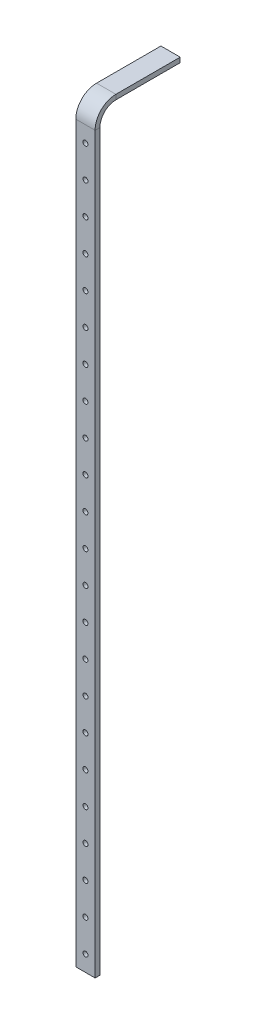
ISO-10303-21;
HEADER;
FILE_DESCRIPTION(('STEP AP214'),'2;1');
FILE_NAME('part.step','',(''),(''),'','','');
FILE_SCHEMA(('AUTOMOTIVE_DESIGN { 1 0 10303 214 1 1 1 1 }'));
ENDSEC;
DATA;
#1=APPLICATION_CONTEXT('core data for automotive mechanical design processes');
#2=APPLICATION_PROTOCOL_DEFINITION('international standard','automotive_design',2000,#1);
#3=PRODUCT_CONTEXT('',#1,'mechanical');
#4=PRODUCT('Part','Part','',(#3));
#5=PRODUCT_RELATED_PRODUCT_CATEGORY('part','',(#4));
#6=PRODUCT_DEFINITION_FORMATION('','',#4);
#7=PRODUCT_DEFINITION_CONTEXT('part definition',#1,'design');
#8=PRODUCT_DEFINITION('design','',#6,#7);
#9=PRODUCT_DEFINITION_SHAPE('','',#8);
#10=(LENGTH_UNIT() NAMED_UNIT(*) SI_UNIT(.MILLI.,.METRE.));
#11=(NAMED_UNIT(*) PLANE_ANGLE_UNIT() SI_UNIT($,.RADIAN.));
#12=(NAMED_UNIT(*) SI_UNIT($,.STERADIAN.) SOLID_ANGLE_UNIT());
#13=UNCERTAINTY_MEASURE_WITH_UNIT(LENGTH_MEASURE(1.E-05),#10,'distance_accuracy_value','');
#14=(GEOMETRIC_REPRESENTATION_CONTEXT(3) GLOBAL_UNCERTAINTY_ASSIGNED_CONTEXT((#13)) GLOBAL_UNIT_ASSIGNED_CONTEXT((#10,
#11,#12)) REPRESENTATION_CONTEXT('',''));
#15=CARTESIAN_POINT('',(0.,0.,0.));
#16=DIRECTION('',(0.,0.,1.));
#17=DIRECTION('',(1.,0.,0.));
#18=AXIS2_PLACEMENT_3D('',#15,#16,#17);
#19=CARTESIAN_POINT('',(12.7,0.,0.));
#20=DIRECTION('',(-1.,0.,0.));
#21=DIRECTION('',(0.,1.,0.));
#22=AXIS2_PLACEMENT_3D('',#19,#20,#21);
#23=PLANE('',#22);
#24=DIRECTION('',(0.,0.,-1.));
#25=VECTOR('',#24,1.);
#26=CARTESIAN_POINT('',(12.7,483.,0.));
#27=LINE('',#26,#25);
#28=CARTESIAN_POINT('',(12.7,483.,3.17500000000002));
#29=VERTEX_POINT('',#28);
#30=CARTESIAN_POINT('',(12.7,483.,0.));
#31=VERTEX_POINT('',#30);
#32=EDGE_CURVE('E13',#29,#31,#27,.T.);
#33=ORIENTED_EDGE('',*,*,#32,.F.);
#34=DIRECTION('',(0.,1.,0.));
#35=VECTOR('',#34,1.);
#36=CARTESIAN_POINT('',(12.7,0.,3.175));
#37=LINE('',#36,#35);
#38=CARTESIAN_POINT('',(12.7,0.,3.175));
#39=VERTEX_POINT('',#38);
#40=EDGE_CURVE('E186',#39,#29,#37,.T.);
#41=ORIENTED_EDGE('',*,*,#40,.F.);
#42=DIRECTION('',(0.,0.,-1.));
#43=VECTOR('',#42,1.);
#44=CARTESIAN_POINT('',(12.7,0.,0.));
#45=LINE('',#44,#43);
#46=CARTESIAN_POINT('',(12.7,0.,0.));
#47=VERTEX_POINT('',#46);
#48=EDGE_CURVE('E68',#39,#47,#45,.T.);
#49=ORIENTED_EDGE('',*,*,#48,.T.);
#50=DIRECTION('',(0.,1.,0.));
#51=VECTOR('',#50,1.);
#52=CARTESIAN_POINT('',(12.7,0.,0.));
#53=LINE('',#52,#51);
#54=EDGE_CURVE('E176',#47,#31,#53,.T.);
#55=ORIENTED_EDGE('',*,*,#54,.T.);
#56=EDGE_LOOP('',(#33,#41,#49,#55));
#57=FACE_BOUND('',#56,.T.);
#58=ADVANCED_FACE('F59',(#57),#23,.F.);
#59=CARTESIAN_POINT('',(0.,0.,0.));
#60=DIRECTION('',(0.,1.,0.));
#61=DIRECTION('',(1.,0.,0.));
#62=AXIS2_PLACEMENT_3D('',#59,#60,#61);
#63=PLANE('',#62);
#64=ORIENTED_EDGE('',*,*,#48,.F.);
#65=DIRECTION('',(-1.,0.,0.));
#66=VECTOR('',#65,1.);
#67=CARTESIAN_POINT('',(0.,0.,3.175));
#68=LINE('',#67,#66);
#69=CARTESIAN_POINT('',(0.,0.,3.175));
#70=VERTEX_POINT('',#69);
#71=EDGE_CURVE('E174',#70,#39,#68,.F.);
#72=ORIENTED_EDGE('',*,*,#71,.F.);
#73=DIRECTION('',(0.,0.,-1.));
#74=VECTOR('',#73,1.);
#75=CARTESIAN_POINT('',(0.,0.,0.));
#76=LINE('',#75,#74);
#77=CARTESIAN_POINT('',(0.,0.,0.));
#78=VERTEX_POINT('',#77);
#79=EDGE_CURVE('E77',#70,#78,#76,.T.);
#80=ORIENTED_EDGE('',*,*,#79,.T.);
#81=DIRECTION('',(1.,0.,0.));
#82=VECTOR('',#81,1.);
#83=CARTESIAN_POINT('',(0.,0.,0.));
#84=LINE('',#83,#82);
#85=EDGE_CURVE('E179',#78,#47,#84,.T.);
#86=ORIENTED_EDGE('',*,*,#85,.T.);
#87=EDGE_LOOP('',(#64,#72,#80,#86));
#88=FACE_BOUND('',#87,.T.);
#89=ADVANCED_FACE('F300',(#88),#63,.F.);
#90=CARTESIAN_POINT('',(0.,0.,0.));
#91=DIRECTION('',(1.,0.,0.));
#92=DIRECTION('',(0.,-1.,0.));
#93=AXIS2_PLACEMENT_3D('',#90,#91,#92);
#94=PLANE('',#93);
#95=ORIENTED_EDGE('',*,*,#79,.F.);
#96=DIRECTION('',(0.,1.,0.));
#97=VECTOR('',#96,1.);
#98=CARTESIAN_POINT('',(0.,0.,3.175));
#99=LINE('',#98,#97);
#100=CARTESIAN_POINT('',(0.,483.,3.175));
#101=VERTEX_POINT('',#100);
#102=EDGE_CURVE('E167',#101,#70,#99,.F.);
#103=ORIENTED_EDGE('',*,*,#102,.F.);
#104=DIRECTION('',(0.,0.,-1.));
#105=VECTOR('',#104,1.);
#106=CARTESIAN_POINT('',(0.,483.,0.));
#107=LINE('',#106,#105);
#108=CARTESIAN_POINT('',(0.,483.,0.));
#109=VERTEX_POINT('',#108);
#110=EDGE_CURVE('E181',#101,#109,#107,.T.);
#111=ORIENTED_EDGE('',*,*,#110,.T.);
#112=DIRECTION('',(0.,-1.,0.));
#113=VECTOR('',#112,1.);
#114=CARTESIAN_POINT('',(0.,0.,0.));
#115=LINE('',#114,#113);
#116=EDGE_CURVE('E171',#109,#78,#115,.T.);
#117=ORIENTED_EDGE('',*,*,#116,.T.);
#118=EDGE_LOOP('',(#95,#103,#111,#117));
#119=FACE_BOUND('',#118,.T.);
#120=ADVANCED_FACE('F302',(#119),#94,.F.);
#121=CARTESIAN_POINT('',(0.,0.,0.));
#122=DIRECTION('',(0.,0.,-1.));
#123=DIRECTION('',(-1.,0.,0.));
#124=AXIS2_PLACEMENT_3D('',#121,#122,#123);
#125=PLANE('',#124);
#126=CARTESIAN_POINT('',(6.34999999999999,10.5,0.));
#127=DIRECTION('',(0.,0.,-1.));
#128=DIRECTION('',(-1.,0.,0.));
#129=AXIS2_PLACEMENT_3D('',#126,#127,#128);
#130=CIRCLE('',#129,1.64999999999999);
#131=CARTESIAN_POINT('',(4.70000000000001,10.5,0.));
#132=VERTEX_POINT('',#131);
#133=EDGE_CURVE('E435',#132,#132,#130,.T.);
#134=ORIENTED_EDGE('',*,*,#133,.F.);
#135=EDGE_LOOP('',(#134));
#136=FACE_BOUND('',#135,.T.);
#137=CARTESIAN_POINT('',(6.34999999999999,31.5,0.));
#138=DIRECTION('',(0.,0.,-1.));
#139=DIRECTION('',(-1.,0.,0.));
#140=AXIS2_PLACEMENT_3D('',#137,#138,#139);
#141=CIRCLE('',#140,1.64999999999999);
#142=CARTESIAN_POINT('',(4.70000000000001,31.5,0.));
#143=VERTEX_POINT('',#142);
#144=EDGE_CURVE('E445',#143,#143,#141,.T.);
#145=ORIENTED_EDGE('',*,*,#144,.F.);
#146=EDGE_LOOP('',(#145));
#147=FACE_BOUND('',#146,.T.);
#148=CARTESIAN_POINT('',(6.34999999999999,52.5,0.));
#149=DIRECTION('',(0.,0.,-1.));
#150=DIRECTION('',(-1.,0.,0.));
#151=AXIS2_PLACEMENT_3D('',#148,#149,#150);
#152=CIRCLE('',#151,1.64999999999999);
#153=CARTESIAN_POINT('',(4.70000000000001,52.5,0.));
#154=VERTEX_POINT('',#153);
#155=EDGE_CURVE('E451',#154,#154,#152,.T.);
#156=ORIENTED_EDGE('',*,*,#155,.F.);
#157=EDGE_LOOP('',(#156));
#158=FACE_BOUND('',#157,.T.);
#159=CARTESIAN_POINT('',(6.34999999999999,73.5,0.));
#160=DIRECTION('',(0.,0.,-1.));
#161=DIRECTION('',(-1.,0.,0.));
#162=AXIS2_PLACEMENT_3D('',#159,#160,#161);
#163=CIRCLE('',#162,1.64999999999999);
#164=CARTESIAN_POINT('',(4.70000000000001,73.5,0.));
#165=VERTEX_POINT('',#164);
#166=EDGE_CURVE('E457',#165,#165,#163,.T.);
#167=ORIENTED_EDGE('',*,*,#166,.F.);
#168=EDGE_LOOP('',(#167));
#169=FACE_BOUND('',#168,.T.);
#170=CARTESIAN_POINT('',(6.34999999999999,94.5,0.));
#171=DIRECTION('',(0.,0.,-1.));
#172=DIRECTION('',(-1.,0.,0.));
#173=AXIS2_PLACEMENT_3D('',#170,#171,#172);
#174=CIRCLE('',#173,1.64999999999999);
#175=CARTESIAN_POINT('',(4.70000000000001,94.5,0.));
#176=VERTEX_POINT('',#175);
#177=EDGE_CURVE('E463',#176,#176,#174,.T.);
#178=ORIENTED_EDGE('',*,*,#177,.F.);
#179=EDGE_LOOP('',(#178));
#180=FACE_BOUND('',#179,.T.);
#181=CARTESIAN_POINT('',(6.34999999999999,115.5,0.));
#182=DIRECTION('',(0.,0.,-1.));
#183=DIRECTION('',(-1.,0.,0.));
#184=AXIS2_PLACEMENT_3D('',#181,#182,#183);
#185=CIRCLE('',#184,1.64999999999999);
#186=CARTESIAN_POINT('',(4.70000000000001,115.5,0.));
#187=VERTEX_POINT('',#186);
#188=EDGE_CURVE('E469',#187,#187,#185,.T.);
#189=ORIENTED_EDGE('',*,*,#188,.F.);
#190=EDGE_LOOP('',(#189));
#191=FACE_BOUND('',#190,.T.);
#192=CARTESIAN_POINT('',(6.34999999999999,136.5,0.));
#193=DIRECTION('',(0.,0.,-1.));
#194=DIRECTION('',(-1.,0.,0.));
#195=AXIS2_PLACEMENT_3D('',#192,#193,#194);
#196=CIRCLE('',#195,1.64999999999999);
#197=CARTESIAN_POINT('',(4.70000000000001,136.5,0.));
#198=VERTEX_POINT('',#197);
#199=EDGE_CURVE('E475',#198,#198,#196,.T.);
#200=ORIENTED_EDGE('',*,*,#199,.F.);
#201=EDGE_LOOP('',(#200));
#202=FACE_BOUND('',#201,.T.);
#203=CARTESIAN_POINT('',(6.34999999999999,157.5,0.));
#204=DIRECTION('',(0.,0.,-1.));
#205=DIRECTION('',(-1.,0.,0.));
#206=AXIS2_PLACEMENT_3D('',#203,#204,#205);
#207=CIRCLE('',#206,1.64999999999999);
#208=CARTESIAN_POINT('',(4.70000000000001,157.5,0.));
#209=VERTEX_POINT('',#208);
#210=EDGE_CURVE('E481',#209,#209,#207,.T.);
#211=ORIENTED_EDGE('',*,*,#210,.F.);
#212=EDGE_LOOP('',(#211));
#213=FACE_BOUND('',#212,.T.);
#214=CARTESIAN_POINT('',(6.34999999999999,178.5,0.));
#215=DIRECTION('',(0.,0.,-1.));
#216=DIRECTION('',(-1.,0.,0.));
#217=AXIS2_PLACEMENT_3D('',#214,#215,#216);
#218=CIRCLE('',#217,1.64999999999999);
#219=CARTESIAN_POINT('',(4.70000000000001,178.5,0.));
#220=VERTEX_POINT('',#219);
#221=EDGE_CURVE('E62',#220,#220,#218,.T.);
#222=ORIENTED_EDGE('',*,*,#221,.F.);
#223=EDGE_LOOP('',(#222));
#224=FACE_BOUND('',#223,.T.);
#225=CARTESIAN_POINT('',(6.34999999999999,199.5,0.));
#226=DIRECTION('',(0.,0.,-1.));
#227=DIRECTION('',(-1.,0.,0.));
#228=AXIS2_PLACEMENT_3D('',#225,#226,#227);
#229=CIRCLE('',#228,1.64999999999999);
#230=CARTESIAN_POINT('',(4.70000000000001,199.5,0.));
#231=VERTEX_POINT('',#230);
#232=EDGE_CURVE('E490',#231,#231,#229,.T.);
#233=ORIENTED_EDGE('',*,*,#232,.F.);
#234=EDGE_LOOP('',(#233));
#235=FACE_BOUND('',#234,.T.);
#236=CARTESIAN_POINT('',(6.34999999999999,220.5,0.));
#237=DIRECTION('',(0.,0.,-1.));
#238=DIRECTION('',(-1.,0.,0.));
#239=AXIS2_PLACEMENT_3D('',#236,#237,#238);
#240=CIRCLE('',#239,1.64999999999999);
#241=CARTESIAN_POINT('',(4.70000000000001,220.5,0.));
#242=VERTEX_POINT('',#241);
#243=EDGE_CURVE('E203',#242,#242,#240,.T.);
#244=ORIENTED_EDGE('',*,*,#243,.F.);
#245=EDGE_LOOP('',(#244));
#246=FACE_BOUND('',#245,.T.);
#247=CARTESIAN_POINT('',(6.34999999999999,241.5,0.));
#248=DIRECTION('',(0.,0.,-1.));
#249=DIRECTION('',(-1.,0.,0.));
#250=AXIS2_PLACEMENT_3D('',#247,#248,#249);
#251=CIRCLE('',#250,1.64999999999999);
#252=CARTESIAN_POINT('',(4.70000000000001,241.5,0.));
#253=VERTEX_POINT('',#252);
#254=EDGE_CURVE('E193',#253,#253,#251,.T.);
#255=ORIENTED_EDGE('',*,*,#254,.F.);
#256=EDGE_LOOP('',(#255));
#257=FACE_BOUND('',#256,.T.);
#258=CARTESIAN_POINT('',(6.34999999999999,262.5,0.));
#259=DIRECTION('',(0.,0.,-1.));
#260=DIRECTION('',(-1.,0.,0.));
#261=AXIS2_PLACEMENT_3D('',#258,#259,#260);
#262=CIRCLE('',#261,1.64999999999999);
#263=CARTESIAN_POINT('',(4.70000000000001,262.5,0.));
#264=VERTEX_POINT('',#263);
#265=EDGE_CURVE('E200',#264,#264,#262,.T.);
#266=ORIENTED_EDGE('',*,*,#265,.F.);
#267=EDGE_LOOP('',(#266));
#268=FACE_BOUND('',#267,.T.);
#269=CARTESIAN_POINT('',(6.34999999999999,283.5,0.));
#270=DIRECTION('',(0.,0.,-1.));
#271=DIRECTION('',(-1.,0.,0.));
#272=AXIS2_PLACEMENT_3D('',#269,#270,#271);
#273=CIRCLE('',#272,1.64999999999999);
#274=CARTESIAN_POINT('',(4.70000000000001,283.5,0.));
#275=VERTEX_POINT('',#274);
#276=EDGE_CURVE('E217',#275,#275,#273,.T.);
#277=ORIENTED_EDGE('',*,*,#276,.F.);
#278=EDGE_LOOP('',(#277));
#279=FACE_BOUND('',#278,.T.);
#280=CARTESIAN_POINT('',(6.34999999999999,304.5,0.));
#281=DIRECTION('',(0.,0.,-1.));
#282=DIRECTION('',(-1.,0.,0.));
#283=AXIS2_PLACEMENT_3D('',#280,#281,#282);
#284=CIRCLE('',#283,1.64999999999999);
#285=CARTESIAN_POINT('',(4.70000000000001,304.5,0.));
#286=VERTEX_POINT('',#285);
#287=EDGE_CURVE('E223',#286,#286,#284,.T.);
#288=ORIENTED_EDGE('',*,*,#287,.F.);
#289=EDGE_LOOP('',(#288));
#290=FACE_BOUND('',#289,.T.);
#291=CARTESIAN_POINT('',(6.34999999999999,325.5,0.));
#292=DIRECTION('',(0.,0.,-1.));
#293=DIRECTION('',(-1.,0.,0.));
#294=AXIS2_PLACEMENT_3D('',#291,#292,#293);
#295=CIRCLE('',#294,1.64999999999999);
#296=CARTESIAN_POINT('',(4.70000000000001,325.5,0.));
#297=VERTEX_POINT('',#296);
#298=EDGE_CURVE('E229',#297,#297,#295,.T.);
#299=ORIENTED_EDGE('',*,*,#298,.F.);
#300=EDGE_LOOP('',(#299));
#301=FACE_BOUND('',#300,.T.);
#302=CARTESIAN_POINT('',(6.34999999999999,346.5,0.));
#303=DIRECTION('',(0.,0.,-1.));
#304=DIRECTION('',(-1.,0.,0.));
#305=AXIS2_PLACEMENT_3D('',#302,#303,#304);
#306=CIRCLE('',#305,1.64999999999999);
#307=CARTESIAN_POINT('',(4.70000000000001,346.5,0.));
#308=VERTEX_POINT('',#307);
#309=EDGE_CURVE('E235',#308,#308,#306,.T.);
#310=ORIENTED_EDGE('',*,*,#309,.F.);
#311=EDGE_LOOP('',(#310));
#312=FACE_BOUND('',#311,.T.);
#313=CARTESIAN_POINT('',(6.34999999999999,367.5,0.));
#314=DIRECTION('',(0.,0.,-1.));
#315=DIRECTION('',(-1.,0.,0.));
#316=AXIS2_PLACEMENT_3D('',#313,#314,#315);
#317=CIRCLE('',#316,1.64999999999999);
#318=CARTESIAN_POINT('',(4.70000000000001,367.5,0.));
#319=VERTEX_POINT('',#318);
#320=EDGE_CURVE('E241',#319,#319,#317,.T.);
#321=ORIENTED_EDGE('',*,*,#320,.F.);
#322=EDGE_LOOP('',(#321));
#323=FACE_BOUND('',#322,.T.);
#324=CARTESIAN_POINT('',(6.34999999999999,388.5,0.));
#325=DIRECTION('',(0.,0.,-1.));
#326=DIRECTION('',(-1.,0.,0.));
#327=AXIS2_PLACEMENT_3D('',#324,#325,#326);
#328=CIRCLE('',#327,1.64999999999999);
#329=CARTESIAN_POINT('',(4.70000000000001,388.5,0.));
#330=VERTEX_POINT('',#329);
#331=EDGE_CURVE('E247',#330,#330,#328,.T.);
#332=ORIENTED_EDGE('',*,*,#331,.F.);
#333=EDGE_LOOP('',(#332));
#334=FACE_BOUND('',#333,.T.);
#335=CARTESIAN_POINT('',(6.34999999999999,409.5,0.));
#336=DIRECTION('',(0.,0.,-1.));
#337=DIRECTION('',(-1.,0.,0.));
#338=AXIS2_PLACEMENT_3D('',#335,#336,#337);
#339=CIRCLE('',#338,1.64999999999999);
#340=CARTESIAN_POINT('',(4.70000000000001,409.5,0.));
#341=VERTEX_POINT('',#340);
#342=EDGE_CURVE('E253',#341,#341,#339,.T.);
#343=ORIENTED_EDGE('',*,*,#342,.F.);
#344=EDGE_LOOP('',(#343));
#345=FACE_BOUND('',#344,.T.);
#346=CARTESIAN_POINT('',(6.34999999999999,430.5,0.));
#347=DIRECTION('',(0.,0.,-1.));
#348=DIRECTION('',(-1.,0.,0.));
#349=AXIS2_PLACEMENT_3D('',#346,#347,#348);
#350=CIRCLE('',#349,1.64999999999999);
#351=CARTESIAN_POINT('',(4.70000000000001,430.5,0.));
#352=VERTEX_POINT('',#351);
#353=EDGE_CURVE('E259',#352,#352,#350,.T.);
#354=ORIENTED_EDGE('',*,*,#353,.F.);
#355=EDGE_LOOP('',(#354));
#356=FACE_BOUND('',#355,.T.);
#357=CARTESIAN_POINT('',(6.34999999999999,451.5,0.));
#358=DIRECTION('',(0.,0.,-1.));
#359=DIRECTION('',(-1.,0.,0.));
#360=AXIS2_PLACEMENT_3D('',#357,#358,#359);
#361=CIRCLE('',#360,1.64999999999999);
#362=CARTESIAN_POINT('',(4.70000000000001,451.5,0.));
#363=VERTEX_POINT('',#362);
#364=EDGE_CURVE('E265',#363,#363,#361,.T.);
#365=ORIENTED_EDGE('',*,*,#364,.F.);
#366=EDGE_LOOP('',(#365));
#367=FACE_BOUND('',#366,.T.);
#368=CARTESIAN_POINT('',(6.34999999999999,472.5,0.));
#369=DIRECTION('',(0.,0.,-1.));
#370=DIRECTION('',(-1.,0.,0.));
#371=AXIS2_PLACEMENT_3D('',#368,#369,#370);
#372=CIRCLE('',#371,1.64999999999999);
#373=CARTESIAN_POINT('',(4.70000000000001,472.5,0.));
#374=VERTEX_POINT('',#373);
#375=EDGE_CURVE('E165',#374,#374,#372,.T.);
#376=ORIENTED_EDGE('',*,*,#375,.F.);
#377=EDGE_LOOP('',(#376));
#378=FACE_BOUND('',#377,.T.);
#379=ORIENTED_EDGE('',*,*,#116,.F.);
#380=DIRECTION('',(-1.,0.,0.));
#381=VECTOR('',#380,1.);
#382=CARTESIAN_POINT('',(0.,483.,0.));
#383=LINE('',#382,#381);
#384=EDGE_CURVE('E173',#31,#109,#383,.T.);
#385=ORIENTED_EDGE('',*,*,#384,.F.);
#386=ORIENTED_EDGE('',*,*,#54,.F.);
#387=ORIENTED_EDGE('',*,*,#85,.F.);
#388=EDGE_LOOP('',(#379,#385,#386,#387));
#389=FACE_BOUND('',#388,.T.);
#390=ADVANCED_FACE('F307',(#136,#147,#158,#169,#180,#191,#202,#213,#224,#235,#246,#257,#268,
#279,#290,#301,#312,#323,#334,#345,#356,#367,#378,#389),#125,.T.);
#391=CARTESIAN_POINT('',(0.,0.,3.175));
#392=DIRECTION('',(0.,0.,-1.));
#393=DIRECTION('',(-1.,0.,0.));
#394=AXIS2_PLACEMENT_3D('',#391,#392,#393);
#395=PLANE('',#394);
#396=CARTESIAN_POINT('',(6.34999999999999,10.5,3.175));
#397=DIRECTION('',(0.,0.,1.));
#398=DIRECTION('',(1.,0.,0.));
#399=AXIS2_PLACEMENT_3D('',#396,#397,#398);
#400=CIRCLE('',#399,1.64999999999999);
#401=CARTESIAN_POINT('',(7.99999999999998,10.5,3.175));
#402=VERTEX_POINT('',#401);
#403=EDGE_CURVE('E438',#402,#402,#400,.T.);
#404=ORIENTED_EDGE('',*,*,#403,.F.);
#405=EDGE_LOOP('',(#404));
#406=FACE_BOUND('',#405,.T.);
#407=CARTESIAN_POINT('',(6.34999999999999,31.5,3.175));
#408=DIRECTION('',(0.,0.,1.));
#409=DIRECTION('',(1.,0.,0.));
#410=AXIS2_PLACEMENT_3D('',#407,#408,#409);
#411=CIRCLE('',#410,1.64999999999999);
#412=CARTESIAN_POINT('',(7.99999999999998,31.5,3.175));
#413=VERTEX_POINT('',#412);
#414=EDGE_CURVE('E440',#413,#413,#411,.T.);
#415=ORIENTED_EDGE('',*,*,#414,.F.);
#416=EDGE_LOOP('',(#415));
#417=FACE_BOUND('',#416,.T.);
#418=CARTESIAN_POINT('',(6.34999999999999,52.5,3.175));
#419=DIRECTION('',(0.,0.,1.));
#420=DIRECTION('',(1.,0.,0.));
#421=AXIS2_PLACEMENT_3D('',#418,#419,#420);
#422=CIRCLE('',#421,1.64999999999999);
#423=CARTESIAN_POINT('',(7.99999999999998,52.5,3.175));
#424=VERTEX_POINT('',#423);
#425=EDGE_CURVE('E448',#424,#424,#422,.T.);
#426=ORIENTED_EDGE('',*,*,#425,.F.);
#427=EDGE_LOOP('',(#426));
#428=FACE_BOUND('',#427,.T.);
#429=CARTESIAN_POINT('',(6.34999999999999,73.5,3.175));
#430=DIRECTION('',(0.,0.,1.));
#431=DIRECTION('',(1.,0.,0.));
#432=AXIS2_PLACEMENT_3D('',#429,#430,#431);
#433=CIRCLE('',#432,1.64999999999999);
#434=CARTESIAN_POINT('',(7.99999999999998,73.5,3.175));
#435=VERTEX_POINT('',#434);
#436=EDGE_CURVE('E454',#435,#435,#433,.T.);
#437=ORIENTED_EDGE('',*,*,#436,.F.);
#438=EDGE_LOOP('',(#437));
#439=FACE_BOUND('',#438,.T.);
#440=CARTESIAN_POINT('',(6.34999999999999,94.5,3.175));
#441=DIRECTION('',(0.,0.,1.));
#442=DIRECTION('',(1.,0.,0.));
#443=AXIS2_PLACEMENT_3D('',#440,#441,#442);
#444=CIRCLE('',#443,1.64999999999999);
#445=CARTESIAN_POINT('',(7.99999999999998,94.5,3.175));
#446=VERTEX_POINT('',#445);
#447=EDGE_CURVE('E460',#446,#446,#444,.T.);
#448=ORIENTED_EDGE('',*,*,#447,.F.);
#449=EDGE_LOOP('',(#448));
#450=FACE_BOUND('',#449,.T.);
#451=CARTESIAN_POINT('',(6.34999999999999,115.5,3.175));
#452=DIRECTION('',(0.,0.,1.));
#453=DIRECTION('',(1.,0.,0.));
#454=AXIS2_PLACEMENT_3D('',#451,#452,#453);
#455=CIRCLE('',#454,1.64999999999999);
#456=CARTESIAN_POINT('',(7.99999999999998,115.5,3.175));
#457=VERTEX_POINT('',#456);
#458=EDGE_CURVE('E466',#457,#457,#455,.T.);
#459=ORIENTED_EDGE('',*,*,#458,.F.);
#460=EDGE_LOOP('',(#459));
#461=FACE_BOUND('',#460,.T.);
#462=CARTESIAN_POINT('',(6.34999999999999,136.5,3.175));
#463=DIRECTION('',(0.,0.,1.));
#464=DIRECTION('',(1.,0.,0.));
#465=AXIS2_PLACEMENT_3D('',#462,#463,#464);
#466=CIRCLE('',#465,1.64999999999999);
#467=CARTESIAN_POINT('',(7.99999999999998,136.5,3.175));
#468=VERTEX_POINT('',#467);
#469=EDGE_CURVE('E472',#468,#468,#466,.T.);
#470=ORIENTED_EDGE('',*,*,#469,.F.);
#471=EDGE_LOOP('',(#470));
#472=FACE_BOUND('',#471,.T.);
#473=CARTESIAN_POINT('',(6.34999999999999,157.5,3.175));
#474=DIRECTION('',(0.,0.,1.));
#475=DIRECTION('',(1.,0.,0.));
#476=AXIS2_PLACEMENT_3D('',#473,#474,#475);
#477=CIRCLE('',#476,1.64999999999999);
#478=CARTESIAN_POINT('',(7.99999999999998,157.5,3.175));
#479=VERTEX_POINT('',#478);
#480=EDGE_CURVE('E478',#479,#479,#477,.T.);
#481=ORIENTED_EDGE('',*,*,#480,.F.);
#482=EDGE_LOOP('',(#481));
#483=FACE_BOUND('',#482,.T.);
#484=CARTESIAN_POINT('',(6.34999999999999,178.5,3.175));
#485=DIRECTION('',(0.,0.,1.));
#486=DIRECTION('',(1.,0.,0.));
#487=AXIS2_PLACEMENT_3D('',#484,#485,#486);
#488=CIRCLE('',#487,1.64999999999999);
#489=CARTESIAN_POINT('',(7.99999999999998,178.5,3.175));
#490=VERTEX_POINT('',#489);
#491=EDGE_CURVE('E484',#490,#490,#488,.T.);
#492=ORIENTED_EDGE('',*,*,#491,.F.);
#493=EDGE_LOOP('',(#492));
#494=FACE_BOUND('',#493,.T.);
#495=CARTESIAN_POINT('',(6.34999999999999,199.5,3.175));
#496=DIRECTION('',(0.,0.,1.));
#497=DIRECTION('',(1.,0.,0.));
#498=AXIS2_PLACEMENT_3D('',#495,#496,#497);
#499=CIRCLE('',#498,1.64999999999999);
#500=CARTESIAN_POINT('',(7.99999999999998,199.5,3.175));
#501=VERTEX_POINT('',#500);
#502=EDGE_CURVE('E487',#501,#501,#499,.T.);
#503=ORIENTED_EDGE('',*,*,#502,.F.);
#504=EDGE_LOOP('',(#503));
#505=FACE_BOUND('',#504,.T.);
#506=CARTESIAN_POINT('',(6.34999999999999,220.5,3.175));
#507=DIRECTION('',(0.,0.,1.));
#508=DIRECTION('',(1.,0.,0.));
#509=AXIS2_PLACEMENT_3D('',#506,#507,#508);
#510=CIRCLE('',#509,1.64999999999999);
#511=CARTESIAN_POINT('',(7.99999999999998,220.5,3.175));
#512=VERTEX_POINT('',#511);
#513=EDGE_CURVE('E208',#512,#512,#510,.T.);
#514=ORIENTED_EDGE('',*,*,#513,.F.);
#515=EDGE_LOOP('',(#514));
#516=FACE_BOUND('',#515,.T.);
#517=CARTESIAN_POINT('',(6.34999999999999,241.5,3.175));
#518=DIRECTION('',(0.,0.,1.));
#519=DIRECTION('',(1.,0.,0.));
#520=AXIS2_PLACEMENT_3D('',#517,#518,#519);
#521=CIRCLE('',#520,1.64999999999999);
#522=CARTESIAN_POINT('',(7.99999999999998,241.5,3.175));
#523=VERTEX_POINT('',#522);
#524=EDGE_CURVE('E196',#523,#523,#521,.T.);
#525=ORIENTED_EDGE('',*,*,#524,.F.);
#526=EDGE_LOOP('',(#525));
#527=FACE_BOUND('',#526,.T.);
#528=CARTESIAN_POINT('',(6.34999999999999,262.5,3.175));
#529=DIRECTION('',(0.,0.,1.));
#530=DIRECTION('',(1.,0.,0.));
#531=AXIS2_PLACEMENT_3D('',#528,#529,#530);
#532=CIRCLE('',#531,1.64999999999999);
#533=CARTESIAN_POINT('',(7.99999999999998,262.5,3.175));
#534=VERTEX_POINT('',#533);
#535=EDGE_CURVE('E195',#534,#534,#532,.T.);
#536=ORIENTED_EDGE('',*,*,#535,.F.);
#537=EDGE_LOOP('',(#536));
#538=FACE_BOUND('',#537,.T.);
#539=CARTESIAN_POINT('',(6.34999999999999,283.5,3.175));
#540=DIRECTION('',(0.,0.,1.));
#541=DIRECTION('',(1.,0.,0.));
#542=AXIS2_PLACEMENT_3D('',#539,#540,#541);
#543=CIRCLE('',#542,1.64999999999999);
#544=CARTESIAN_POINT('',(7.99999999999998,283.5,3.175));
#545=VERTEX_POINT('',#544);
#546=EDGE_CURVE('E214',#545,#545,#543,.T.);
#547=ORIENTED_EDGE('',*,*,#546,.F.);
#548=EDGE_LOOP('',(#547));
#549=FACE_BOUND('',#548,.T.);
#550=CARTESIAN_POINT('',(6.34999999999999,304.5,3.175));
#551=DIRECTION('',(0.,0.,1.));
#552=DIRECTION('',(1.,0.,0.));
#553=AXIS2_PLACEMENT_3D('',#550,#551,#552);
#554=CIRCLE('',#553,1.64999999999999);
#555=CARTESIAN_POINT('',(7.99999999999998,304.5,3.175));
#556=VERTEX_POINT('',#555);
#557=EDGE_CURVE('E220',#556,#556,#554,.T.);
#558=ORIENTED_EDGE('',*,*,#557,.F.);
#559=EDGE_LOOP('',(#558));
#560=FACE_BOUND('',#559,.T.);
#561=CARTESIAN_POINT('',(6.34999999999999,325.5,3.175));
#562=DIRECTION('',(0.,0.,1.));
#563=DIRECTION('',(1.,0.,0.));
#564=AXIS2_PLACEMENT_3D('',#561,#562,#563);
#565=CIRCLE('',#564,1.64999999999999);
#566=CARTESIAN_POINT('',(7.99999999999998,325.5,3.175));
#567=VERTEX_POINT('',#566);
#568=EDGE_CURVE('E226',#567,#567,#565,.T.);
#569=ORIENTED_EDGE('',*,*,#568,.F.);
#570=EDGE_LOOP('',(#569));
#571=FACE_BOUND('',#570,.T.);
#572=CARTESIAN_POINT('',(6.34999999999999,346.5,3.175));
#573=DIRECTION('',(0.,0.,1.));
#574=DIRECTION('',(1.,0.,0.));
#575=AXIS2_PLACEMENT_3D('',#572,#573,#574);
#576=CIRCLE('',#575,1.64999999999999);
#577=CARTESIAN_POINT('',(7.99999999999998,346.5,3.175));
#578=VERTEX_POINT('',#577);
#579=EDGE_CURVE('E232',#578,#578,#576,.T.);
#580=ORIENTED_EDGE('',*,*,#579,.F.);
#581=EDGE_LOOP('',(#580));
#582=FACE_BOUND('',#581,.T.);
#583=CARTESIAN_POINT('',(6.34999999999999,367.5,3.175));
#584=DIRECTION('',(0.,0.,1.));
#585=DIRECTION('',(1.,0.,0.));
#586=AXIS2_PLACEMENT_3D('',#583,#584,#585);
#587=CIRCLE('',#586,1.64999999999999);
#588=CARTESIAN_POINT('',(7.99999999999998,367.5,3.175));
#589=VERTEX_POINT('',#588);
#590=EDGE_CURVE('E238',#589,#589,#587,.T.);
#591=ORIENTED_EDGE('',*,*,#590,.F.);
#592=EDGE_LOOP('',(#591));
#593=FACE_BOUND('',#592,.T.);
#594=CARTESIAN_POINT('',(6.34999999999999,388.5,3.175));
#595=DIRECTION('',(0.,0.,1.));
#596=DIRECTION('',(1.,0.,0.));
#597=AXIS2_PLACEMENT_3D('',#594,#595,#596);
#598=CIRCLE('',#597,1.64999999999999);
#599=CARTESIAN_POINT('',(7.99999999999998,388.5,3.175));
#600=VERTEX_POINT('',#599);
#601=EDGE_CURVE('E244',#600,#600,#598,.T.);
#602=ORIENTED_EDGE('',*,*,#601,.F.);
#603=EDGE_LOOP('',(#602));
#604=FACE_BOUND('',#603,.T.);
#605=CARTESIAN_POINT('',(6.34999999999999,409.5,3.175));
#606=DIRECTION('',(0.,0.,1.));
#607=DIRECTION('',(1.,0.,0.));
#608=AXIS2_PLACEMENT_3D('',#605,#606,#607);
#609=CIRCLE('',#608,1.64999999999999);
#610=CARTESIAN_POINT('',(7.99999999999998,409.5,3.175));
#611=VERTEX_POINT('',#610);
#612=EDGE_CURVE('E250',#611,#611,#609,.T.);
#613=ORIENTED_EDGE('',*,*,#612,.F.);
#614=EDGE_LOOP('',(#613));
#615=FACE_BOUND('',#614,.T.);
#616=CARTESIAN_POINT('',(6.34999999999999,430.5,3.175));
#617=DIRECTION('',(0.,0.,1.));
#618=DIRECTION('',(1.,0.,0.));
#619=AXIS2_PLACEMENT_3D('',#616,#617,#618);
#620=CIRCLE('',#619,1.64999999999999);
#621=CARTESIAN_POINT('',(7.99999999999998,430.5,3.175));
#622=VERTEX_POINT('',#621);
#623=EDGE_CURVE('E256',#622,#622,#620,.T.);
#624=ORIENTED_EDGE('',*,*,#623,.F.);
#625=EDGE_LOOP('',(#624));
#626=FACE_BOUND('',#625,.T.);
#627=CARTESIAN_POINT('',(6.34999999999999,451.5,3.175));
#628=DIRECTION('',(0.,0.,1.));
#629=DIRECTION('',(1.,0.,0.));
#630=AXIS2_PLACEMENT_3D('',#627,#628,#629);
#631=CIRCLE('',#630,1.64999999999999);
#632=CARTESIAN_POINT('',(7.99999999999998,451.5,3.175));
#633=VERTEX_POINT('',#632);
#634=EDGE_CURVE('E262',#633,#633,#631,.T.);
#635=ORIENTED_EDGE('',*,*,#634,.F.);
#636=EDGE_LOOP('',(#635));
#637=FACE_BOUND('',#636,.T.);
#638=CARTESIAN_POINT('',(6.34999999999999,472.5,3.175));
#639=DIRECTION('',(0.,0.,1.));
#640=DIRECTION('',(1.,0.,0.));
#641=AXIS2_PLACEMENT_3D('',#638,#639,#640);
#642=CIRCLE('',#641,1.64999999999999);
#643=CARTESIAN_POINT('',(7.99999999999998,472.5,3.175));
#644=VERTEX_POINT('',#643);
#645=EDGE_CURVE('E268',#644,#644,#642,.T.);
#646=ORIENTED_EDGE('',*,*,#645,.F.);
#647=EDGE_LOOP('',(#646));
#648=FACE_BOUND('',#647,.T.);
#649=ORIENTED_EDGE('',*,*,#102,.T.);
#650=ORIENTED_EDGE('',*,*,#71,.T.);
#651=ORIENTED_EDGE('',*,*,#40,.T.);
#652=DIRECTION('',(-1.,0.,0.));
#653=VECTOR('',#652,1.);
#654=CARTESIAN_POINT('',(0.,483.,3.175));
#655=LINE('',#654,#653);
#656=EDGE_CURVE('E99',#29,#101,#655,.T.);
#657=ORIENTED_EDGE('',*,*,#656,.T.);
#658=EDGE_LOOP('',(#649,#650,#651,#657));
#659=FACE_BOUND('',#658,.T.);
#660=ADVANCED_FACE('F298',(#406,#417,#428,#439,#450,#461,#472,#483,#494,#505,#516,#527,#538,
#549,#560,#571,#582,#593,#604,#615,#626,#637,#648,#659),#395,.F.);
#661=CARTESIAN_POINT('',(0.,483.,-10.5));
#662=DIRECTION('',(-1.,0.,0.));
#663=DIRECTION('',(0.,0.,1.));
#664=AXIS2_PLACEMENT_3D('',#661,#662,#663);
#665=PLANE('',#664);
#666=DIRECTION('',(0.,-1.,0.));
#667=VECTOR('',#666,1.);
#668=CARTESIAN_POINT('',(0.,496.675,-10.4999999999999));
#669=LINE('',#668,#667);
#670=CARTESIAN_POINT('',(0.,493.5,-10.5));
#671=VERTEX_POINT('',#670);
#672=CARTESIAN_POINT('',(0.,496.675,-10.4999999999999));
#673=VERTEX_POINT('',#672);
#674=EDGE_CURVE('E130',#671,#673,#669,.F.);
#675=ORIENTED_EDGE('',*,*,#674,.F.);
#676=CARTESIAN_POINT('',(0.,483.,-10.5));
#677=DIRECTION('',(1.,0.,0.));
#678=DIRECTION('',(0.,0.,-1.));
#679=AXIS2_PLACEMENT_3D('',#676,#677,#678);
#680=CIRCLE('',#679,10.5);
#681=EDGE_CURVE('E124',#109,#671,#680,.F.);
#682=ORIENTED_EDGE('',*,*,#681,.F.);
#683=ORIENTED_EDGE('',*,*,#110,.F.);
#684=CARTESIAN_POINT('',(0.,483.,-10.5));
#685=DIRECTION('',(1.,0.,0.));
#686=DIRECTION('',(0.,0.,-1.));
#687=AXIS2_PLACEMENT_3D('',#684,#685,#686);
#688=CIRCLE('',#687,13.675);
#689=EDGE_CURVE('E93',#101,#673,#688,.F.);
#690=ORIENTED_EDGE('',*,*,#689,.T.);
#691=EDGE_LOOP('',(#675,#682,#683,#690));
#692=FACE_BOUND('',#691,.T.);
#693=ADVANCED_FACE('F313',(#692),#665,.T.);
#694=CARTESIAN_POINT('',(12.7,483.,-10.5));
#695=DIRECTION('',(-1.,0.,0.));
#696=DIRECTION('',(0.,0.,1.));
#697=AXIS2_PLACEMENT_3D('',#694,#695,#696);
#698=PLANE('',#697);
#699=CARTESIAN_POINT('',(12.7,483.,-10.5));
#700=DIRECTION('',(1.,0.,0.));
#701=DIRECTION('',(0.,0.,-1.));
#702=AXIS2_PLACEMENT_3D('',#699,#700,#701);
#703=CIRCLE('',#702,10.5);
#704=CARTESIAN_POINT('',(12.7,493.5,-10.5));
#705=VERTEX_POINT('',#704);
#706=EDGE_CURVE('E121',#705,#31,#703,.T.);
#707=ORIENTED_EDGE('',*,*,#706,.F.);
#708=DIRECTION('',(0.,-1.,0.));
#709=VECTOR('',#708,1.);
#710=CARTESIAN_POINT('',(12.7,493.5,-10.5));
#711=LINE('',#710,#709);
#712=CARTESIAN_POINT('',(12.7,496.675,-10.4999999999999));
#713=VERTEX_POINT('',#712);
#714=EDGE_CURVE('E129',#705,#713,#711,.F.);
#715=ORIENTED_EDGE('',*,*,#714,.T.);
#716=CARTESIAN_POINT('',(12.7,483.,-10.5));
#717=DIRECTION('',(1.,0.,0.));
#718=DIRECTION('',(0.,0.,-1.));
#719=AXIS2_PLACEMENT_3D('',#716,#717,#718);
#720=CIRCLE('',#719,13.675);
#721=EDGE_CURVE('E168',#713,#29,#720,.T.);
#722=ORIENTED_EDGE('',*,*,#721,.T.);
#723=ORIENTED_EDGE('',*,*,#32,.T.);
#724=EDGE_LOOP('',(#707,#715,#722,#723));
#725=FACE_BOUND('',#724,.T.);
#726=ADVANCED_FACE('F135',(#725),#698,.F.);
#727=CARTESIAN_POINT('',(12.7,483.,-10.5));
#728=DIRECTION('',(1.,0.,0.));
#729=DIRECTION('',(0.,1.,0.));
#730=AXIS2_PLACEMENT_3D('',#727,#728,#729);
#731=CYLINDRICAL_SURFACE('',#730,13.675);
#732=ORIENTED_EDGE('',*,*,#656,.F.);
#733=ORIENTED_EDGE('',*,*,#721,.F.);
#734=DIRECTION('',(1.,0.,0.));
#735=VECTOR('',#734,1.);
#736=CARTESIAN_POINT('',(0.,496.675,-10.4999999999999));
#737=LINE('',#736,#735);
#738=EDGE_CURVE('E151',#713,#673,#737,.F.);
#739=ORIENTED_EDGE('',*,*,#738,.T.);
#740=ORIENTED_EDGE('',*,*,#689,.F.);
#741=EDGE_LOOP('',(#732,#733,#739,#740));
#742=FACE_BOUND('',#741,.T.);
#743=ADVANCED_FACE('F294',(#742),#731,.T.);
#744=CARTESIAN_POINT('',(12.7,483.,-10.5));
#745=DIRECTION('',(1.,0.,0.));
#746=DIRECTION('',(0.,1.,0.));
#747=AXIS2_PLACEMENT_3D('',#744,#745,#746);
#748=CYLINDRICAL_SURFACE('',#747,10.5);
#749=ORIENTED_EDGE('',*,*,#384,.T.);
#750=ORIENTED_EDGE('',*,*,#681,.T.);
#751=DIRECTION('',(1.,0.,0.));
#752=VECTOR('',#751,1.);
#753=CARTESIAN_POINT('',(0.,493.5,-10.5));
#754=LINE('',#753,#752);
#755=EDGE_CURVE('E118',#671,#705,#754,.T.);
#756=ORIENTED_EDGE('',*,*,#755,.T.);
#757=ORIENTED_EDGE('',*,*,#706,.T.);
#758=EDGE_LOOP('',(#749,#750,#756,#757));
#759=FACE_BOUND('',#758,.T.);
#760=ADVANCED_FACE('F120',(#759),#748,.F.);
#761=CARTESIAN_POINT('',(12.7,496.675,-52.825));
#762=DIRECTION('',(-1.,0.,0.));
#763=DIRECTION('',(0.,0.,1.));
#764=AXIS2_PLACEMENT_3D('',#761,#762,#763);
#765=PLANE('',#764);
#766=ORIENTED_EDGE('',*,*,#714,.F.);
#767=DIRECTION('',(0.,0.,1.));
#768=VECTOR('',#767,1.);
#769=CARTESIAN_POINT('',(12.7,493.5,-52.825));
#770=LINE('',#769,#768);
#771=CARTESIAN_POINT('',(12.7,493.5,-52.825));
#772=VERTEX_POINT('',#771);
#773=EDGE_CURVE('E147',#705,#772,#770,.F.);
#774=ORIENTED_EDGE('',*,*,#773,.T.);
#775=DIRECTION('',(0.,-1.,0.));
#776=VECTOR('',#775,1.);
#777=CARTESIAN_POINT('',(12.7,496.675,-52.825));
#778=LINE('',#777,#776);
#779=CARTESIAN_POINT('',(12.7,496.675,-52.825));
#780=VERTEX_POINT('',#779);
#781=EDGE_CURVE('E139',#780,#772,#778,.T.);
#782=ORIENTED_EDGE('',*,*,#781,.F.);
#783=DIRECTION('',(0.,0.,-1.));
#784=VECTOR('',#783,1.);
#785=CARTESIAN_POINT('',(12.7,496.675,1.53376710273673E-12));
#786=LINE('',#785,#784);
#787=EDGE_CURVE('E150',#713,#780,#786,.T.);
#788=ORIENTED_EDGE('',*,*,#787,.F.);
#789=EDGE_LOOP('',(#766,#774,#782,#788));
#790=FACE_BOUND('',#789,.T.);
#791=ADVANCED_FACE('F144',(#790),#765,.F.);
#792=CARTESIAN_POINT('',(0.,496.675,0.));
#793=DIRECTION('',(1.,0.,0.));
#794=DIRECTION('',(0.,0.,-1.));
#795=AXIS2_PLACEMENT_3D('',#792,#793,#794);
#796=PLANE('',#795);
#797=ORIENTED_EDGE('',*,*,#674,.T.);
#798=DIRECTION('',(0.,0.,1.));
#799=VECTOR('',#798,1.);
#800=CARTESIAN_POINT('',(0.,496.675,1.53376710273673E-12));
#801=LINE('',#800,#799);
#802=CARTESIAN_POINT('',(0.,496.675,-52.825));
#803=VERTEX_POINT('',#802);
#804=EDGE_CURVE('E277',#803,#673,#801,.T.);
#805=ORIENTED_EDGE('',*,*,#804,.F.);
#806=DIRECTION('',(0.,-1.,0.));
#807=VECTOR('',#806,1.);
#808=CARTESIAN_POINT('',(0.,496.675,-52.825));
#809=LINE('',#808,#807);
#810=CARTESIAN_POINT('',(0.,493.5,-52.825));
#811=VERTEX_POINT('',#810);
#812=EDGE_CURVE('E274',#803,#811,#809,.T.);
#813=ORIENTED_EDGE('',*,*,#812,.T.);
#814=DIRECTION('',(0.,0.,-1.));
#815=VECTOR('',#814,1.);
#816=CARTESIAN_POINT('',(0.,493.5,0.));
#817=LINE('',#816,#815);
#818=EDGE_CURVE('E158',#811,#671,#817,.F.);
#819=ORIENTED_EDGE('',*,*,#818,.T.);
#820=EDGE_LOOP('',(#797,#805,#813,#819));
#821=FACE_BOUND('',#820,.T.);
#822=ADVANCED_FACE('F284',(#821),#796,.F.);
#823=CARTESIAN_POINT('',(0.,496.675,1.53376710273673E-12));
#824=DIRECTION('',(0.,-1.,0.));
#825=DIRECTION('',(0.,0.,-1.));
#826=AXIS2_PLACEMENT_3D('',#823,#824,#825);
#827=PLANE('',#826);
#828=ORIENTED_EDGE('',*,*,#738,.F.);
#829=ORIENTED_EDGE('',*,*,#787,.T.);
#830=DIRECTION('',(-1.,0.,0.));
#831=VECTOR('',#830,1.);
#832=CARTESIAN_POINT('',(0.,496.675,-52.825));
#833=LINE('',#832,#831);
#834=EDGE_CURVE('E280',#780,#803,#833,.T.);
#835=ORIENTED_EDGE('',*,*,#834,.T.);
#836=ORIENTED_EDGE('',*,*,#804,.T.);
#837=EDGE_LOOP('',(#828,#829,#835,#836));
#838=FACE_BOUND('',#837,.T.);
#839=ADVANCED_FACE('F335',(#838),#827,.F.);
#840=CARTESIAN_POINT('',(0.,493.5,1.5226816494859E-12));
#841=DIRECTION('',(0.,-1.,0.));
#842=DIRECTION('',(0.,0.,-1.));
#843=AXIS2_PLACEMENT_3D('',#840,#841,#842);
#844=PLANE('',#843);
#845=ORIENTED_EDGE('',*,*,#773,.F.);
#846=ORIENTED_EDGE('',*,*,#755,.F.);
#847=ORIENTED_EDGE('',*,*,#818,.F.);
#848=DIRECTION('',(1.,0.,0.));
#849=VECTOR('',#848,1.);
#850=CARTESIAN_POINT('',(0.,493.5,-52.825));
#851=LINE('',#850,#849);
#852=EDGE_CURVE('E156',#772,#811,#851,.F.);
#853=ORIENTED_EDGE('',*,*,#852,.F.);
#854=EDGE_LOOP('',(#845,#846,#847,#853));
#855=FACE_BOUND('',#854,.T.);
#856=ADVANCED_FACE('F154',(#855),#844,.T.);
#857=CARTESIAN_POINT('',(0.,496.675,-52.825));
#858=DIRECTION('',(0.,0.,1.));
#859=DIRECTION('',(0.,-1.,0.));
#860=AXIS2_PLACEMENT_3D('',#857,#858,#859);
#861=PLANE('',#860);
#862=ORIENTED_EDGE('',*,*,#852,.T.);
#863=ORIENTED_EDGE('',*,*,#812,.F.);
#864=ORIENTED_EDGE('',*,*,#834,.F.);
#865=ORIENTED_EDGE('',*,*,#781,.T.);
#866=EDGE_LOOP('',(#862,#863,#864,#865));
#867=FACE_BOUND('',#866,.T.);
#868=ADVANCED_FACE('F329',(#867),#861,.F.);
#869=CARTESIAN_POINT('',(6.34999999999999,472.5,3.175));
#870=DIRECTION('',(0.,0.,1.));
#871=DIRECTION('',(1.,0.,0.));
#872=AXIS2_PLACEMENT_3D('',#869,#870,#871);
#873=CYLINDRICAL_SURFACE('',#872,1.64999999999999);
#874=ORIENTED_EDGE('',*,*,#375,.T.);
#875=EDGE_LOOP('',(#874));
#876=FACE_BOUND('',#875,.T.);
#877=ORIENTED_EDGE('',*,*,#645,.T.);
#878=EDGE_LOOP('',(#877));
#879=FACE_BOUND('',#878,.T.);
#880=ADVANCED_FACE('F332',(#876,#879),#873,.F.);
#881=CARTESIAN_POINT('',(6.34999999999999,451.5,3.175));
#882=DIRECTION('',(0.,0.,1.));
#883=DIRECTION('',(1.,0.,0.));
#884=AXIS2_PLACEMENT_3D('',#881,#882,#883);
#885=CYLINDRICAL_SURFACE('',#884,1.64999999999999);
#886=ORIENTED_EDGE('',*,*,#364,.T.);
#887=EDGE_LOOP('',(#886));
#888=FACE_BOUND('',#887,.T.);
#889=ORIENTED_EDGE('',*,*,#634,.T.);
#890=EDGE_LOOP('',(#889));
#891=FACE_BOUND('',#890,.T.);
#892=ADVANCED_FACE('F343',(#888,#891),#885,.F.);
#893=CARTESIAN_POINT('',(6.34999999999999,430.5,3.175));
#894=DIRECTION('',(0.,0.,1.));
#895=DIRECTION('',(1.,0.,0.));
#896=AXIS2_PLACEMENT_3D('',#893,#894,#895);
#897=CYLINDRICAL_SURFACE('',#896,1.64999999999999);
#898=ORIENTED_EDGE('',*,*,#353,.T.);
#899=EDGE_LOOP('',(#898));
#900=FACE_BOUND('',#899,.T.);
#901=ORIENTED_EDGE('',*,*,#623,.T.);
#902=EDGE_LOOP('',(#901));
#903=FACE_BOUND('',#902,.T.);
#904=ADVANCED_FACE('F347',(#900,#903),#897,.F.);
#905=CARTESIAN_POINT('',(6.34999999999999,409.5,3.175));
#906=DIRECTION('',(0.,0.,1.));
#907=DIRECTION('',(1.,0.,0.));
#908=AXIS2_PLACEMENT_3D('',#905,#906,#907);
#909=CYLINDRICAL_SURFACE('',#908,1.64999999999999);
#910=ORIENTED_EDGE('',*,*,#342,.T.);
#911=EDGE_LOOP('',(#910));
#912=FACE_BOUND('',#911,.T.);
#913=ORIENTED_EDGE('',*,*,#612,.T.);
#914=EDGE_LOOP('',(#913));
#915=FACE_BOUND('',#914,.T.);
#916=ADVANCED_FACE('F351',(#912,#915),#909,.F.);
#917=CARTESIAN_POINT('',(6.34999999999999,388.5,3.175));
#918=DIRECTION('',(0.,0.,1.));
#919=DIRECTION('',(1.,0.,0.));
#920=AXIS2_PLACEMENT_3D('',#917,#918,#919);
#921=CYLINDRICAL_SURFACE('',#920,1.64999999999999);
#922=ORIENTED_EDGE('',*,*,#331,.T.);
#923=EDGE_LOOP('',(#922));
#924=FACE_BOUND('',#923,.T.);
#925=ORIENTED_EDGE('',*,*,#601,.T.);
#926=EDGE_LOOP('',(#925));
#927=FACE_BOUND('',#926,.T.);
#928=ADVANCED_FACE('F355',(#924,#927),#921,.F.);
#929=CARTESIAN_POINT('',(6.34999999999999,367.5,3.175));
#930=DIRECTION('',(0.,0.,1.));
#931=DIRECTION('',(1.,0.,0.));
#932=AXIS2_PLACEMENT_3D('',#929,#930,#931);
#933=CYLINDRICAL_SURFACE('',#932,1.64999999999999);
#934=ORIENTED_EDGE('',*,*,#320,.T.);
#935=EDGE_LOOP('',(#934));
#936=FACE_BOUND('',#935,.T.);
#937=ORIENTED_EDGE('',*,*,#590,.T.);
#938=EDGE_LOOP('',(#937));
#939=FACE_BOUND('',#938,.T.);
#940=ADVANCED_FACE('F359',(#936,#939),#933,.F.);
#941=CARTESIAN_POINT('',(6.34999999999999,346.5,3.175));
#942=DIRECTION('',(0.,0.,1.));
#943=DIRECTION('',(1.,0.,0.));
#944=AXIS2_PLACEMENT_3D('',#941,#942,#943);
#945=CYLINDRICAL_SURFACE('',#944,1.64999999999999);
#946=ORIENTED_EDGE('',*,*,#309,.T.);
#947=EDGE_LOOP('',(#946));
#948=FACE_BOUND('',#947,.T.);
#949=ORIENTED_EDGE('',*,*,#579,.T.);
#950=EDGE_LOOP('',(#949));
#951=FACE_BOUND('',#950,.T.);
#952=ADVANCED_FACE('F363',(#948,#951),#945,.F.);
#953=CARTESIAN_POINT('',(6.34999999999999,325.5,3.175));
#954=DIRECTION('',(0.,0.,1.));
#955=DIRECTION('',(1.,0.,0.));
#956=AXIS2_PLACEMENT_3D('',#953,#954,#955);
#957=CYLINDRICAL_SURFACE('',#956,1.64999999999999);
#958=ORIENTED_EDGE('',*,*,#298,.T.);
#959=EDGE_LOOP('',(#958));
#960=FACE_BOUND('',#959,.T.);
#961=ORIENTED_EDGE('',*,*,#568,.T.);
#962=EDGE_LOOP('',(#961));
#963=FACE_BOUND('',#962,.T.);
#964=ADVANCED_FACE('F367',(#960,#963),#957,.F.);
#965=CARTESIAN_POINT('',(6.34999999999999,304.5,3.175));
#966=DIRECTION('',(0.,0.,1.));
#967=DIRECTION('',(1.,0.,0.));
#968=AXIS2_PLACEMENT_3D('',#965,#966,#967);
#969=CYLINDRICAL_SURFACE('',#968,1.64999999999999);
#970=ORIENTED_EDGE('',*,*,#287,.T.);
#971=EDGE_LOOP('',(#970));
#972=FACE_BOUND('',#971,.T.);
#973=ORIENTED_EDGE('',*,*,#557,.T.);
#974=EDGE_LOOP('',(#973));
#975=FACE_BOUND('',#974,.T.);
#976=ADVANCED_FACE('F371',(#972,#975),#969,.F.);
#977=CARTESIAN_POINT('',(6.34999999999999,283.5,3.175));
#978=DIRECTION('',(0.,0.,1.));
#979=DIRECTION('',(1.,0.,0.));
#980=AXIS2_PLACEMENT_3D('',#977,#978,#979);
#981=CYLINDRICAL_SURFACE('',#980,1.64999999999999);
#982=ORIENTED_EDGE('',*,*,#276,.T.);
#983=EDGE_LOOP('',(#982));
#984=FACE_BOUND('',#983,.T.);
#985=ORIENTED_EDGE('',*,*,#546,.T.);
#986=EDGE_LOOP('',(#985));
#987=FACE_BOUND('',#986,.T.);
#988=ADVANCED_FACE('F375',(#984,#987),#981,.F.);
#989=CARTESIAN_POINT('',(6.34999999999999,262.5,3.175));
#990=DIRECTION('',(0.,0.,1.));
#991=DIRECTION('',(1.,0.,0.));
#992=AXIS2_PLACEMENT_3D('',#989,#990,#991);
#993=CYLINDRICAL_SURFACE('',#992,1.64999999999999);
#994=ORIENTED_EDGE('',*,*,#265,.T.);
#995=EDGE_LOOP('',(#994));
#996=FACE_BOUND('',#995,.T.);
#997=ORIENTED_EDGE('',*,*,#535,.T.);
#998=EDGE_LOOP('',(#997));
#999=FACE_BOUND('',#998,.T.);
#1000=ADVANCED_FACE('F379',(#996,#999),#993,.F.);
#1001=CARTESIAN_POINT('',(6.34999999999999,241.5,3.175));
#1002=DIRECTION('',(0.,0.,1.));
#1003=DIRECTION('',(1.,0.,0.));
#1004=AXIS2_PLACEMENT_3D('',#1001,#1002,#1003);
#1005=CYLINDRICAL_SURFACE('',#1004,1.64999999999999);
#1006=ORIENTED_EDGE('',*,*,#254,.T.);
#1007=EDGE_LOOP('',(#1006));
#1008=FACE_BOUND('',#1007,.T.);
#1009=ORIENTED_EDGE('',*,*,#524,.T.);
#1010=EDGE_LOOP('',(#1009));
#1011=FACE_BOUND('',#1010,.T.);
#1012=ADVANCED_FACE('F383',(#1008,#1011),#1005,.F.);
#1013=CARTESIAN_POINT('',(6.34999999999999,220.5,3.175));
#1014=DIRECTION('',(0.,0.,1.));
#1015=DIRECTION('',(1.,0.,0.));
#1016=AXIS2_PLACEMENT_3D('',#1013,#1014,#1015);
#1017=CYLINDRICAL_SURFACE('',#1016,1.64999999999999);
#1018=ORIENTED_EDGE('',*,*,#243,.T.);
#1019=EDGE_LOOP('',(#1018));
#1020=FACE_BOUND('',#1019,.T.);
#1021=ORIENTED_EDGE('',*,*,#513,.T.);
#1022=EDGE_LOOP('',(#1021));
#1023=FACE_BOUND('',#1022,.T.);
#1024=ADVANCED_FACE('F387',(#1020,#1023),#1017,.F.);
#1025=CARTESIAN_POINT('',(6.34999999999999,199.5,3.175));
#1026=DIRECTION('',(0.,0.,1.));
#1027=DIRECTION('',(1.,0.,0.));
#1028=AXIS2_PLACEMENT_3D('',#1025,#1026,#1027);
#1029=CYLINDRICAL_SURFACE('',#1028,1.64999999999999);
#1030=ORIENTED_EDGE('',*,*,#232,.T.);
#1031=EDGE_LOOP('',(#1030));
#1032=FACE_BOUND('',#1031,.T.);
#1033=ORIENTED_EDGE('',*,*,#502,.T.);
#1034=EDGE_LOOP('',(#1033));
#1035=FACE_BOUND('',#1034,.T.);
#1036=ADVANCED_FACE('F390',(#1032,#1035),#1029,.F.);
#1037=CARTESIAN_POINT('',(6.34999999999999,178.5,3.175));
#1038=DIRECTION('',(0.,0.,1.));
#1039=DIRECTION('',(1.,0.,0.));
#1040=AXIS2_PLACEMENT_3D('',#1037,#1038,#1039);
#1041=CYLINDRICAL_SURFACE('',#1040,1.64999999999999);
#1042=ORIENTED_EDGE('',*,*,#221,.T.);
#1043=EDGE_LOOP('',(#1042));
#1044=FACE_BOUND('',#1043,.T.);
#1045=ORIENTED_EDGE('',*,*,#491,.T.);
#1046=EDGE_LOOP('',(#1045));
#1047=FACE_BOUND('',#1046,.T.);
#1048=ADVANCED_FACE('F394',(#1044,#1047),#1041,.F.);
#1049=CARTESIAN_POINT('',(6.34999999999999,157.5,3.175));
#1050=DIRECTION('',(0.,0.,1.));
#1051=DIRECTION('',(1.,0.,0.));
#1052=AXIS2_PLACEMENT_3D('',#1049,#1050,#1051);
#1053=CYLINDRICAL_SURFACE('',#1052,1.64999999999999);
#1054=ORIENTED_EDGE('',*,*,#210,.T.);
#1055=EDGE_LOOP('',(#1054));
#1056=FACE_BOUND('',#1055,.T.);
#1057=ORIENTED_EDGE('',*,*,#480,.T.);
#1058=EDGE_LOOP('',(#1057));
#1059=FACE_BOUND('',#1058,.T.);
#1060=ADVANCED_FACE('F398',(#1056,#1059),#1053,.F.);
#1061=CARTESIAN_POINT('',(6.34999999999999,136.5,3.175));
#1062=DIRECTION('',(0.,0.,1.));
#1063=DIRECTION('',(1.,0.,0.));
#1064=AXIS2_PLACEMENT_3D('',#1061,#1062,#1063);
#1065=CYLINDRICAL_SURFACE('',#1064,1.64999999999999);
#1066=ORIENTED_EDGE('',*,*,#199,.T.);
#1067=EDGE_LOOP('',(#1066));
#1068=FACE_BOUND('',#1067,.T.);
#1069=ORIENTED_EDGE('',*,*,#469,.T.);
#1070=EDGE_LOOP('',(#1069));
#1071=FACE_BOUND('',#1070,.T.);
#1072=ADVANCED_FACE('F402',(#1068,#1071),#1065,.F.);
#1073=CARTESIAN_POINT('',(6.34999999999999,115.5,3.175));
#1074=DIRECTION('',(0.,0.,1.));
#1075=DIRECTION('',(1.,0.,0.));
#1076=AXIS2_PLACEMENT_3D('',#1073,#1074,#1075);
#1077=CYLINDRICAL_SURFACE('',#1076,1.64999999999999);
#1078=ORIENTED_EDGE('',*,*,#188,.T.);
#1079=EDGE_LOOP('',(#1078));
#1080=FACE_BOUND('',#1079,.T.);
#1081=ORIENTED_EDGE('',*,*,#458,.T.);
#1082=EDGE_LOOP('',(#1081));
#1083=FACE_BOUND('',#1082,.T.);
#1084=ADVANCED_FACE('F406',(#1080,#1083),#1077,.F.);
#1085=CARTESIAN_POINT('',(6.34999999999999,94.5,3.175));
#1086=DIRECTION('',(0.,0.,1.));
#1087=DIRECTION('',(1.,0.,0.));
#1088=AXIS2_PLACEMENT_3D('',#1085,#1086,#1087);
#1089=CYLINDRICAL_SURFACE('',#1088,1.64999999999999);
#1090=ORIENTED_EDGE('',*,*,#177,.T.);
#1091=EDGE_LOOP('',(#1090));
#1092=FACE_BOUND('',#1091,.T.);
#1093=ORIENTED_EDGE('',*,*,#447,.T.);
#1094=EDGE_LOOP('',(#1093));
#1095=FACE_BOUND('',#1094,.T.);
#1096=ADVANCED_FACE('F410',(#1092,#1095),#1089,.F.);
#1097=CARTESIAN_POINT('',(6.34999999999999,73.5,3.175));
#1098=DIRECTION('',(0.,0.,1.));
#1099=DIRECTION('',(1.,0.,0.));
#1100=AXIS2_PLACEMENT_3D('',#1097,#1098,#1099);
#1101=CYLINDRICAL_SURFACE('',#1100,1.64999999999999);
#1102=ORIENTED_EDGE('',*,*,#166,.T.);
#1103=EDGE_LOOP('',(#1102));
#1104=FACE_BOUND('',#1103,.T.);
#1105=ORIENTED_EDGE('',*,*,#436,.T.);
#1106=EDGE_LOOP('',(#1105));
#1107=FACE_BOUND('',#1106,.T.);
#1108=ADVANCED_FACE('F414',(#1104,#1107),#1101,.F.);
#1109=CARTESIAN_POINT('',(6.34999999999999,52.5,3.175));
#1110=DIRECTION('',(0.,0.,1.));
#1111=DIRECTION('',(1.,0.,0.));
#1112=AXIS2_PLACEMENT_3D('',#1109,#1110,#1111);
#1113=CYLINDRICAL_SURFACE('',#1112,1.64999999999999);
#1114=ORIENTED_EDGE('',*,*,#155,.T.);
#1115=EDGE_LOOP('',(#1114));
#1116=FACE_BOUND('',#1115,.T.);
#1117=ORIENTED_EDGE('',*,*,#425,.T.);
#1118=EDGE_LOOP('',(#1117));
#1119=FACE_BOUND('',#1118,.T.);
#1120=ADVANCED_FACE('F418',(#1116,#1119),#1113,.F.);
#1121=CARTESIAN_POINT('',(6.34999999999999,31.5,3.175));
#1122=DIRECTION('',(0.,0.,1.));
#1123=DIRECTION('',(1.,0.,0.));
#1124=AXIS2_PLACEMENT_3D('',#1121,#1122,#1123);
#1125=CYLINDRICAL_SURFACE('',#1124,1.64999999999999);
#1126=ORIENTED_EDGE('',*,*,#144,.T.);
#1127=EDGE_LOOP('',(#1126));
#1128=FACE_BOUND('',#1127,.T.);
#1129=ORIENTED_EDGE('',*,*,#414,.T.);
#1130=EDGE_LOOP('',(#1129));
#1131=FACE_BOUND('',#1130,.T.);
#1132=ADVANCED_FACE('F422',(#1128,#1131),#1125,.F.);
#1133=CARTESIAN_POINT('',(6.34999999999999,10.5,3.175));
#1134=DIRECTION('',(0.,0.,1.));
#1135=DIRECTION('',(1.,0.,0.));
#1136=AXIS2_PLACEMENT_3D('',#1133,#1134,#1135);
#1137=CYLINDRICAL_SURFACE('',#1136,1.64999999999999);
#1138=ORIENTED_EDGE('',*,*,#133,.T.);
#1139=EDGE_LOOP('',(#1138));
#1140=FACE_BOUND('',#1139,.T.);
#1141=ORIENTED_EDGE('',*,*,#403,.T.);
#1142=EDGE_LOOP('',(#1141));
#1143=FACE_BOUND('',#1142,.T.);
#1144=ADVANCED_FACE('F426',(#1140,#1143),#1137,.F.);
#1145=CLOSED_SHELL('',(#58,#89,#120,#390,#660,#693,#726,#743,#760,#791,#822,#839,#856,#868,#880,
#892,#904,#916,#928,#940,#952,#964,#976,#988,#1000,#1012,#1024,#1036,#1048,#1060,#1072,#1084,
#1096,#1108,#1120,#1132,#1144));
#1146=MANIFOLD_SOLID_BREP('B2',#1145);
#1147=ADVANCED_BREP_SHAPE_REPRESENTATION('',(#18,#1146),#14);
#1148=SHAPE_DEFINITION_REPRESENTATION(#9,#1147);
ENDSEC;
END-ISO-10303-21;
